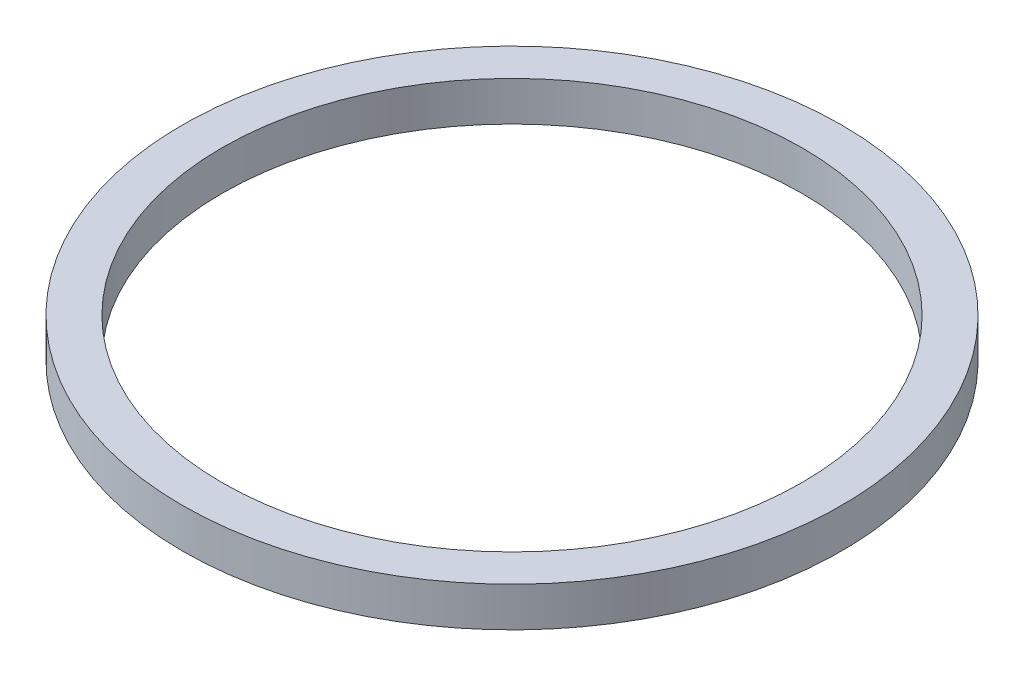
ISO-10303-21;
HEADER;
FILE_DESCRIPTION(('STEP AP214'),'2;1');
FILE_NAME('part.step','',(''),(''),'','','');
FILE_SCHEMA(('AUTOMOTIVE_DESIGN { 1 0 10303 214 1 1 1 1 }'));
ENDSEC;
DATA;
#1=APPLICATION_CONTEXT('core data for automotive mechanical design processes');
#2=APPLICATION_PROTOCOL_DEFINITION('international standard','automotive_design',2000,#1);
#3=PRODUCT_CONTEXT('',#1,'mechanical');
#4=PRODUCT('Part','Part','',(#3));
#5=PRODUCT_RELATED_PRODUCT_CATEGORY('part','',(#4));
#6=PRODUCT_DEFINITION_FORMATION('','',#4);
#7=PRODUCT_DEFINITION_CONTEXT('part definition',#1,'design');
#8=PRODUCT_DEFINITION('design','',#6,#7);
#9=PRODUCT_DEFINITION_SHAPE('','',#8);
#10=(LENGTH_UNIT() NAMED_UNIT(*) SI_UNIT(.MILLI.,.METRE.));
#11=(NAMED_UNIT(*) PLANE_ANGLE_UNIT() SI_UNIT($,.RADIAN.));
#12=(NAMED_UNIT(*) SI_UNIT($,.STERADIAN.) SOLID_ANGLE_UNIT());
#13=UNCERTAINTY_MEASURE_WITH_UNIT(LENGTH_MEASURE(1.E-05),#10,'distance_accuracy_value','');
#14=(GEOMETRIC_REPRESENTATION_CONTEXT(3) GLOBAL_UNCERTAINTY_ASSIGNED_CONTEXT((#13)) GLOBAL_UNIT_ASSIGNED_CONTEXT((#10,
#11,#12)) REPRESENTATION_CONTEXT('',''));
#15=CARTESIAN_POINT('',(0.,0.,0.));
#16=DIRECTION('',(0.,0.,1.));
#17=DIRECTION('',(1.,0.,0.));
#18=AXIS2_PLACEMENT_3D('',#15,#16,#17);
#19=CARTESIAN_POINT('',(0.,3.,0.));
#20=DIRECTION('',(0.,1.,0.));
#21=DIRECTION('',(0.,0.,1.));
#22=AXIS2_PLACEMENT_3D('',#19,#20,#21);
#23=PLANE('',#22);
#24=CARTESIAN_POINT('',(0.,3.,0.));
#25=DIRECTION('',(0.,1.,0.));
#26=DIRECTION('',(0.,0.,1.));
#27=AXIS2_PLACEMENT_3D('',#24,#25,#26);
#28=CIRCLE('',#27,25.);
#29=CARTESIAN_POINT('',(0.,3.,25.));
#30=VERTEX_POINT('',#29);
#31=EDGE_CURVE('E10',#30,#30,#28,.T.);
#32=ORIENTED_EDGE('',*,*,#31,.T.);
#33=EDGE_LOOP('',(#32));
#34=FACE_BOUND('',#33,.T.);
#35=CARTESIAN_POINT('',(0.,3.,0.));
#36=DIRECTION('',(0.,1.,0.));
#37=DIRECTION('',(0.,0.,1.));
#38=AXIS2_PLACEMENT_3D('',#35,#36,#37);
#39=CIRCLE('',#38,22.);
#40=CARTESIAN_POINT('',(0.,3.,22.));
#41=VERTEX_POINT('',#40);
#42=EDGE_CURVE('E42',#41,#41,#39,.T.);
#43=ORIENTED_EDGE('',*,*,#42,.F.);
#44=EDGE_LOOP('',(#43));
#45=FACE_BOUND('',#44,.T.);
#46=ADVANCED_FACE('F31',(#34,#45),#23,.T.);
#47=CARTESIAN_POINT('',(0.,0.,0.));
#48=DIRECTION('',(0.,1.,0.));
#49=DIRECTION('',(0.,0.,1.));
#50=AXIS2_PLACEMENT_3D('',#47,#48,#49);
#51=PLANE('',#50);
#52=CARTESIAN_POINT('',(0.,0.,0.));
#53=DIRECTION('',(0.,1.,0.));
#54=DIRECTION('',(0.,0.,1.));
#55=AXIS2_PLACEMENT_3D('',#52,#53,#54);
#56=CIRCLE('',#55,25.);
#57=CARTESIAN_POINT('',(0.,0.,25.));
#58=VERTEX_POINT('',#57);
#59=EDGE_CURVE('E35',#58,#58,#56,.T.);
#60=ORIENTED_EDGE('',*,*,#59,.F.);
#61=EDGE_LOOP('',(#60));
#62=FACE_BOUND('',#61,.T.);
#63=CARTESIAN_POINT('',(0.,0.,0.));
#64=DIRECTION('',(0.,1.,0.));
#65=DIRECTION('',(0.,0.,1.));
#66=AXIS2_PLACEMENT_3D('',#63,#64,#65);
#67=CIRCLE('',#66,22.);
#68=CARTESIAN_POINT('',(0.,0.,22.));
#69=VERTEX_POINT('',#68);
#70=EDGE_CURVE('E44',#69,#69,#67,.T.);
#71=ORIENTED_EDGE('',*,*,#70,.T.);
#72=EDGE_LOOP('',(#71));
#73=FACE_BOUND('',#72,.T.);
#74=ADVANCED_FACE('F54',(#62,#73),#51,.F.);
#75=CARTESIAN_POINT('',(0.,3.,0.));
#76=DIRECTION('',(0.,-1.,0.));
#77=DIRECTION('',(0.,0.,-1.));
#78=AXIS2_PLACEMENT_3D('',#75,#76,#77);
#79=CYLINDRICAL_SURFACE('',#78,25.);
#80=ORIENTED_EDGE('',*,*,#31,.F.);
#81=EDGE_LOOP('',(#80));
#82=FACE_BOUND('',#81,.T.);
#83=ORIENTED_EDGE('',*,*,#59,.T.);
#84=EDGE_LOOP('',(#83));
#85=FACE_BOUND('',#84,.T.);
#86=ADVANCED_FACE('F33',(#82,#85),#79,.T.);
#87=CARTESIAN_POINT('',(0.,3.,0.));
#88=DIRECTION('',(0.,-1.,0.));
#89=DIRECTION('',(0.,0.,-1.));
#90=AXIS2_PLACEMENT_3D('',#87,#88,#89);
#91=CYLINDRICAL_SURFACE('',#90,22.);
#92=ORIENTED_EDGE('',*,*,#42,.T.);
#93=EDGE_LOOP('',(#92));
#94=FACE_BOUND('',#93,.T.);
#95=ORIENTED_EDGE('',*,*,#70,.F.);
#96=EDGE_LOOP('',(#95));
#97=FACE_BOUND('',#96,.T.);
#98=ADVANCED_FACE('F50',(#94,#97),#91,.F.);
#99=CLOSED_SHELL('',(#46,#74,#86,#98));
#100=MANIFOLD_SOLID_BREP('B2',#99);
#101=ADVANCED_BREP_SHAPE_REPRESENTATION('',(#18,#100),#14);
#102=SHAPE_DEFINITION_REPRESENTATION(#9,#101);
ENDSEC;
END-ISO-10303-21;
